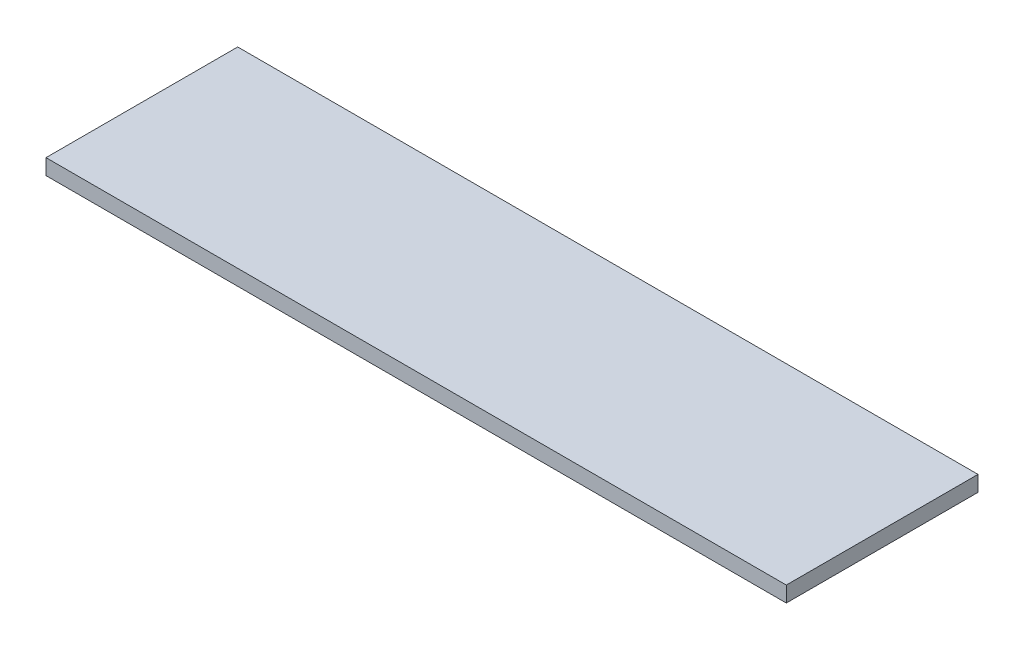
ISO-10303-21;
HEADER;
FILE_DESCRIPTION(('STEP AP214'),'2;1');
FILE_NAME('part.step','',(''),(''),'','','');
FILE_SCHEMA(('AUTOMOTIVE_DESIGN { 1 0 10303 214 1 1 1 1 }'));
ENDSEC;
DATA;
#1=APPLICATION_CONTEXT('core data for automotive mechanical design processes');
#2=APPLICATION_PROTOCOL_DEFINITION('international standard','automotive_design',2000,#1);
#3=PRODUCT_CONTEXT('',#1,'mechanical');
#4=PRODUCT('Part','Part','',(#3));
#5=PRODUCT_RELATED_PRODUCT_CATEGORY('part','',(#4));
#6=PRODUCT_DEFINITION_FORMATION('','',#4);
#7=PRODUCT_DEFINITION_CONTEXT('part definition',#1,'design');
#8=PRODUCT_DEFINITION('design','',#6,#7);
#9=PRODUCT_DEFINITION_SHAPE('','',#8);
#10=(LENGTH_UNIT() NAMED_UNIT(*) SI_UNIT(.MILLI.,.METRE.));
#11=(NAMED_UNIT(*) PLANE_ANGLE_UNIT() SI_UNIT($,.RADIAN.));
#12=(NAMED_UNIT(*) SI_UNIT($,.STERADIAN.) SOLID_ANGLE_UNIT());
#13=UNCERTAINTY_MEASURE_WITH_UNIT(LENGTH_MEASURE(1.E-05),#10,'distance_accuracy_value','');
#14=(GEOMETRIC_REPRESENTATION_CONTEXT(3) GLOBAL_UNCERTAINTY_ASSIGNED_CONTEXT((#13)) GLOBAL_UNIT_ASSIGNED_CONTEXT((#10,
#11,#12)) REPRESENTATION_CONTEXT('',''));
#15=CARTESIAN_POINT('',(0.,0.,0.));
#16=DIRECTION('',(0.,0.,1.));
#17=DIRECTION('',(1.,0.,0.));
#18=AXIS2_PLACEMENT_3D('',#15,#16,#17);
#19=CARTESIAN_POINT('',(0.,1.,0.));
#20=DIRECTION('',(1.,0.,0.));
#21=DIRECTION('',(0.,0.,-1.));
#22=AXIS2_PLACEMENT_3D('',#19,#20,#21);
#23=PLANE('',#22);
#24=DIRECTION('',(0.,0.,1.));
#25=VECTOR('',#24,1.);
#26=CARTESIAN_POINT('',(0.,0.,0.));
#27=LINE('',#26,#25);
#28=CARTESIAN_POINT('',(0.,0.,-12.3));
#29=VERTEX_POINT('',#28);
#30=CARTESIAN_POINT('',(0.,0.,0.));
#31=VERTEX_POINT('',#30);
#32=EDGE_CURVE('E96',#29,#31,#27,.T.);
#33=ORIENTED_EDGE('',*,*,#32,.T.);
#34=DIRECTION('',(0.,-1.,0.));
#35=VECTOR('',#34,1.);
#36=CARTESIAN_POINT('',(0.,1.,0.));
#37=LINE('',#36,#35);
#38=CARTESIAN_POINT('',(0.,1.,0.));
#39=VERTEX_POINT('',#38);
#40=EDGE_CURVE('E11',#39,#31,#37,.T.);
#41=ORIENTED_EDGE('',*,*,#40,.F.);
#42=DIRECTION('',(0.,0.,1.));
#43=VECTOR('',#42,1.);
#44=CARTESIAN_POINT('',(0.,1.,0.));
#45=LINE('',#44,#43);
#46=CARTESIAN_POINT('',(0.,1.,-12.3));
#47=VERTEX_POINT('',#46);
#48=EDGE_CURVE('E84',#47,#39,#45,.T.);
#49=ORIENTED_EDGE('',*,*,#48,.F.);
#50=DIRECTION('',(0.,-1.,0.));
#51=VECTOR('',#50,1.);
#52=CARTESIAN_POINT('',(0.,1.,-12.3));
#53=LINE('',#52,#51);
#54=EDGE_CURVE('E92',#47,#29,#53,.T.);
#55=ORIENTED_EDGE('',*,*,#54,.T.);
#56=EDGE_LOOP('',(#33,#41,#49,#55));
#57=FACE_BOUND('',#56,.T.);
#58=ADVANCED_FACE('F33',(#57),#23,.F.);
#59=CARTESIAN_POINT('',(0.,1.,0.));
#60=DIRECTION('',(0.,0.,-1.));
#61=DIRECTION('',(-1.,0.,0.));
#62=AXIS2_PLACEMENT_3D('',#59,#60,#61);
#63=PLANE('',#62);
#64=DIRECTION('',(1.,0.,0.));
#65=VECTOR('',#64,1.);
#66=CARTESIAN_POINT('',(0.,0.,0.));
#67=LINE('',#66,#65);
#68=CARTESIAN_POINT('',(47.5,0.,0.));
#69=VERTEX_POINT('',#68);
#70=EDGE_CURVE('E88',#31,#69,#67,.T.);
#71=ORIENTED_EDGE('',*,*,#70,.T.);
#72=DIRECTION('',(0.,-1.,0.));
#73=VECTOR('',#72,1.);
#74=CARTESIAN_POINT('',(47.5,1.,0.));
#75=LINE('',#74,#73);
#76=CARTESIAN_POINT('',(47.5,1.,0.));
#77=VERTEX_POINT('',#76);
#78=EDGE_CURVE('E41',#77,#69,#75,.T.);
#79=ORIENTED_EDGE('',*,*,#78,.F.);
#80=DIRECTION('',(1.,0.,0.));
#81=VECTOR('',#80,1.);
#82=CARTESIAN_POINT('',(0.,1.,0.));
#83=LINE('',#82,#81);
#84=EDGE_CURVE('E79',#39,#77,#83,.T.);
#85=ORIENTED_EDGE('',*,*,#84,.F.);
#86=ORIENTED_EDGE('',*,*,#40,.T.);
#87=EDGE_LOOP('',(#71,#79,#85,#86));
#88=FACE_BOUND('',#87,.T.);
#89=ADVANCED_FACE('F87',(#88),#63,.F.);
#90=CARTESIAN_POINT('',(47.5,1.,0.));
#91=DIRECTION('',(-1.,0.,0.));
#92=DIRECTION('',(0.,0.,1.));
#93=AXIS2_PLACEMENT_3D('',#90,#91,#92);
#94=PLANE('',#93);
#95=DIRECTION('',(0.,0.,-1.));
#96=VECTOR('',#95,1.);
#97=CARTESIAN_POINT('',(47.5,0.,0.));
#98=LINE('',#97,#96);
#99=CARTESIAN_POINT('',(47.5,0.,-12.3));
#100=VERTEX_POINT('',#99);
#101=EDGE_CURVE('E66',#69,#100,#98,.T.);
#102=ORIENTED_EDGE('',*,*,#101,.T.);
#103=DIRECTION('',(0.,-1.,0.));
#104=VECTOR('',#103,1.);
#105=CARTESIAN_POINT('',(47.5,1.,-12.3));
#106=LINE('',#105,#104);
#107=CARTESIAN_POINT('',(47.5,1.,-12.3));
#108=VERTEX_POINT('',#107);
#109=EDGE_CURVE('E89',#108,#100,#106,.T.);
#110=ORIENTED_EDGE('',*,*,#109,.F.);
#111=DIRECTION('',(0.,0.,-1.));
#112=VECTOR('',#111,1.);
#113=CARTESIAN_POINT('',(47.5,1.,0.));
#114=LINE('',#113,#112);
#115=EDGE_CURVE('E82',#77,#108,#114,.T.);
#116=ORIENTED_EDGE('',*,*,#115,.F.);
#117=ORIENTED_EDGE('',*,*,#78,.T.);
#118=EDGE_LOOP('',(#102,#110,#116,#117));
#119=FACE_BOUND('',#118,.T.);
#120=ADVANCED_FACE('F90',(#119),#94,.F.);
#121=CARTESIAN_POINT('',(0.,1.,-12.3));
#122=DIRECTION('',(0.,0.,1.));
#123=DIRECTION('',(1.,0.,0.));
#124=AXIS2_PLACEMENT_3D('',#121,#122,#123);
#125=PLANE('',#124);
#126=DIRECTION('',(-1.,0.,0.));
#127=VECTOR('',#126,1.);
#128=CARTESIAN_POINT('',(0.,0.,-12.3));
#129=LINE('',#128,#127);
#130=EDGE_CURVE('E72',#100,#29,#129,.T.);
#131=ORIENTED_EDGE('',*,*,#130,.T.);
#132=ORIENTED_EDGE('',*,*,#54,.F.);
#133=DIRECTION('',(-1.,0.,0.));
#134=VECTOR('',#133,1.);
#135=CARTESIAN_POINT('',(0.,1.,-12.3));
#136=LINE('',#135,#134);
#137=EDGE_CURVE('E49',#108,#47,#136,.T.);
#138=ORIENTED_EDGE('',*,*,#137,.F.);
#139=ORIENTED_EDGE('',*,*,#109,.T.);
#140=EDGE_LOOP('',(#131,#132,#138,#139));
#141=FACE_BOUND('',#140,.T.);
#142=ADVANCED_FACE('F103',(#141),#125,.F.);
#143=CARTESIAN_POINT('',(0.,1.,0.));
#144=DIRECTION('',(0.,-1.,0.));
#145=DIRECTION('',(0.,0.,-1.));
#146=AXIS2_PLACEMENT_3D('',#143,#144,#145);
#147=PLANE('',#146);
#148=ORIENTED_EDGE('',*,*,#48,.T.);
#149=ORIENTED_EDGE('',*,*,#84,.T.);
#150=ORIENTED_EDGE('',*,*,#115,.T.);
#151=ORIENTED_EDGE('',*,*,#137,.T.);
#152=EDGE_LOOP('',(#148,#149,#150,#151));
#153=FACE_BOUND('',#152,.T.);
#154=ADVANCED_FACE('F80',(#153),#147,.F.);
#155=CARTESIAN_POINT('',(0.,0.,0.));
#156=DIRECTION('',(0.,-1.,0.));
#157=DIRECTION('',(0.,0.,-1.));
#158=AXIS2_PLACEMENT_3D('',#155,#156,#157);
#159=PLANE('',#158);
#160=ORIENTED_EDGE('',*,*,#32,.F.);
#161=ORIENTED_EDGE('',*,*,#130,.F.);
#162=ORIENTED_EDGE('',*,*,#101,.F.);
#163=ORIENTED_EDGE('',*,*,#70,.F.);
#164=EDGE_LOOP('',(#160,#161,#162,#163));
#165=FACE_BOUND('',#164,.T.);
#166=ADVANCED_FACE('F106',(#165),#159,.T.);
#167=CLOSED_SHELL('',(#58,#89,#120,#142,#154,#166));
#168=MANIFOLD_SOLID_BREP('B2',#167);
#169=ADVANCED_BREP_SHAPE_REPRESENTATION('',(#18,#168),#14);
#170=SHAPE_DEFINITION_REPRESENTATION(#9,#169);
ENDSEC;
END-ISO-10303-21;
